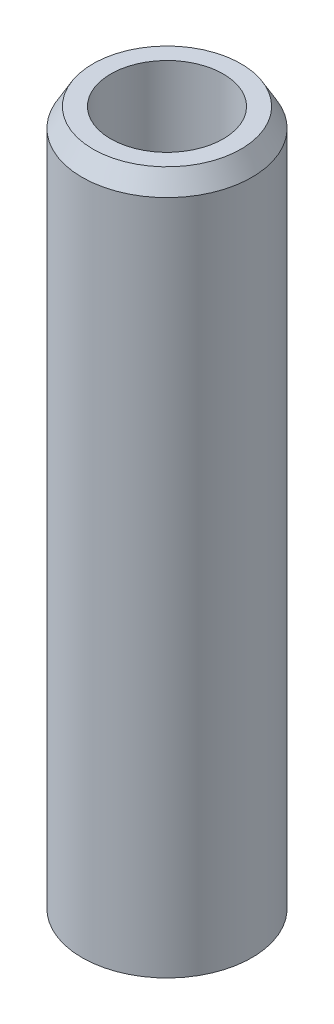
ISO-10303-21;
HEADER;
FILE_DESCRIPTION(('STEP AP214'),'2;1');
FILE_NAME('part.step','',(''),(''),'','','');
FILE_SCHEMA(('AUTOMOTIVE_DESIGN { 1 0 10303 214 1 1 1 1 }'));
ENDSEC;
DATA;
#1=APPLICATION_CONTEXT('core data for automotive mechanical design processes');
#2=APPLICATION_PROTOCOL_DEFINITION('international standard','automotive_design',2000,#1);
#3=PRODUCT_CONTEXT('',#1,'mechanical');
#4=PRODUCT('Part','Part','',(#3));
#5=PRODUCT_RELATED_PRODUCT_CATEGORY('part','',(#4));
#6=PRODUCT_DEFINITION_FORMATION('','',#4);
#7=PRODUCT_DEFINITION_CONTEXT('part definition',#1,'design');
#8=PRODUCT_DEFINITION('design','',#6,#7);
#9=PRODUCT_DEFINITION_SHAPE('','',#8);
#10=(LENGTH_UNIT() NAMED_UNIT(*) SI_UNIT(.MILLI.,.METRE.));
#11=(NAMED_UNIT(*) PLANE_ANGLE_UNIT() SI_UNIT($,.RADIAN.));
#12=(NAMED_UNIT(*) SI_UNIT($,.STERADIAN.) SOLID_ANGLE_UNIT());
#13=UNCERTAINTY_MEASURE_WITH_UNIT(LENGTH_MEASURE(1.E-05),#10,'distance_accuracy_value','');
#14=(GEOMETRIC_REPRESENTATION_CONTEXT(3) GLOBAL_UNCERTAINTY_ASSIGNED_CONTEXT((#13)) GLOBAL_UNIT_ASSIGNED_CONTEXT((#10,
#11,#12)) REPRESENTATION_CONTEXT('',''));
#15=CARTESIAN_POINT('',(0.,0.,0.));
#16=DIRECTION('',(0.,0.,1.));
#17=DIRECTION('',(1.,0.,0.));
#18=AXIS2_PLACEMENT_3D('',#15,#16,#17);
#19=CARTESIAN_POINT('',(0.,186.930161326391,0.));
#20=DIRECTION('',(0.,-1.,0.));
#21=DIRECTION('',(0.,0.,-1.));
#22=AXIS2_PLACEMENT_3D('',#19,#20,#21);
#23=CYLINDRICAL_SURFACE('',#22,22.5);
#24=CARTESIAN_POINT('',(0.,181.912026177805,0.));
#25=DIRECTION('',(0.,1.,0.));
#26=DIRECTION('',(0.,0.,1.));
#27=AXIS2_PLACEMENT_3D('',#24,#25,#26);
#28=CIRCLE('',#27,22.5);
#29=CARTESIAN_POINT('',(0.,181.912026177805,22.5));
#30=VERTEX_POINT('',#29);
#31=EDGE_CURVE('E50',#30,#30,#28,.F.);
#32=ORIENTED_EDGE('',*,*,#31,.T.);
#33=EDGE_LOOP('',(#32));
#34=FACE_BOUND('',#33,.T.);
#35=CARTESIAN_POINT('',(0.,2.89722167886566,0.));
#36=DIRECTION('',(0.,1.,0.));
#37=DIRECTION('',(0.,0.,1.));
#38=AXIS2_PLACEMENT_3D('',#35,#36,#37);
#39=CIRCLE('',#38,22.5);
#40=CARTESIAN_POINT('',(0.,2.89722167886566,22.5));
#41=VERTEX_POINT('',#40);
#42=EDGE_CURVE('E51',#41,#41,#39,.T.);
#43=ORIENTED_EDGE('',*,*,#42,.T.);
#44=EDGE_LOOP('',(#43));
#45=FACE_BOUND('',#44,.T.);
#46=ADVANCED_FACE('F39',(#34,#45),#23,.T.);
#47=CARTESIAN_POINT('',(0.,186.930161326391,0.));
#48=DIRECTION('',(0.,1.,0.));
#49=DIRECTION('',(0.,0.,1.));
#50=AXIS2_PLACEMENT_3D('',#47,#48,#49);
#51=PLANE('',#50);
#52=CARTESIAN_POINT('',(0.,186.930161326391,0.));
#53=DIRECTION('',(0.,1.,0.));
#54=DIRECTION('',(0.,0.,1.));
#55=AXIS2_PLACEMENT_3D('',#52,#53,#54);
#56=CIRCLE('',#55,19.6027783211343);
#57=CARTESIAN_POINT('',(0.,186.930161326391,19.6027783211343));
#58=VERTEX_POINT('',#57);
#59=EDGE_CURVE('E54',#58,#58,#56,.T.);
#60=ORIENTED_EDGE('',*,*,#59,.T.);
#61=EDGE_LOOP('',(#60));
#62=FACE_BOUND('',#61,.T.);
#63=CARTESIAN_POINT('',(0.,186.930161326391,0.));
#64=DIRECTION('',(0.,1.,0.));
#65=DIRECTION('',(0.,0.,1.));
#66=AXIS2_PLACEMENT_3D('',#63,#64,#65);
#67=CIRCLE('',#66,14.9091989872699);
#68=CARTESIAN_POINT('',(0.,186.930161326391,14.9091989872699));
#69=VERTEX_POINT('',#68);
#70=EDGE_CURVE('E58',#69,#69,#67,.T.);
#71=ORIENTED_EDGE('',*,*,#70,.F.);
#72=EDGE_LOOP('',(#71));
#73=FACE_BOUND('',#72,.T.);
#74=ADVANCED_FACE('F69',(#62,#73),#51,.T.);
#75=CARTESIAN_POINT('',(0.,0.,0.));
#76=DIRECTION('',(0.,1.,0.));
#77=DIRECTION('',(0.,0.,1.));
#78=AXIS2_PLACEMENT_3D('',#75,#76,#77);
#79=PLANE('',#78);
#80=CARTESIAN_POINT('',(0.,0.,0.));
#81=DIRECTION('',(0.,1.,0.));
#82=DIRECTION('',(0.,0.,1.));
#83=AXIS2_PLACEMENT_3D('',#80,#81,#82);
#84=CIRCLE('',#83,17.4818648514146);
#85=CARTESIAN_POINT('',(0.,0.,17.4818648514146));
#86=VERTEX_POINT('',#85);
#87=EDGE_CURVE('E10',#86,#86,#84,.F.);
#88=ORIENTED_EDGE('',*,*,#87,.T.);
#89=EDGE_LOOP('',(#88));
#90=FACE_BOUND('',#89,.T.);
#91=CARTESIAN_POINT('',(0.,0.,0.));
#92=DIRECTION('',(0.,1.,0.));
#93=DIRECTION('',(0.,0.,1.));
#94=AXIS2_PLACEMENT_3D('',#91,#92,#93);
#95=CIRCLE('',#94,14.9091989872699);
#96=CARTESIAN_POINT('',(0.,0.,14.9091989872699));
#97=VERTEX_POINT('',#96);
#98=EDGE_CURVE('E63',#97,#97,#95,.T.);
#99=ORIENTED_EDGE('',*,*,#98,.T.);
#100=EDGE_LOOP('',(#99));
#101=FACE_BOUND('',#100,.T.);
#102=ADVANCED_FACE('F75',(#90,#101),#79,.F.);
#103=CARTESIAN_POINT('',(0.,186.930161326391,0.));
#104=DIRECTION('',(0.,-1.,0.));
#105=DIRECTION('',(0.,0.,-1.));
#106=AXIS2_PLACEMENT_3D('',#103,#104,#105);
#107=CYLINDRICAL_SURFACE('',#106,14.9091989872699);
#108=ORIENTED_EDGE('',*,*,#70,.T.);
#109=EDGE_LOOP('',(#108));
#110=FACE_BOUND('',#109,.T.);
#111=ORIENTED_EDGE('',*,*,#98,.F.);
#112=EDGE_LOOP('',(#111));
#113=FACE_BOUND('',#112,.T.);
#114=ADVANCED_FACE('F70',(#110,#113),#107,.F.);
#115=CARTESIAN_POINT('',(0.,186.930161326391,0.));
#116=DIRECTION('',(0.,-1.,0.));
#117=DIRECTION('',(0.,0.,-1.));
#118=AXIS2_PLACEMENT_3D('',#115,#116,#117);
#119=CONICAL_SURFACE('',#118,19.6027783211343,0.523598775598295);
#120=ORIENTED_EDGE('',*,*,#31,.F.);
#121=EDGE_LOOP('',(#120));
#122=FACE_BOUND('',#121,.T.);
#123=ORIENTED_EDGE('',*,*,#59,.F.);
#124=EDGE_LOOP('',(#123));
#125=FACE_BOUND('',#124,.T.);
#126=ADVANCED_FACE('F81',(#122,#125),#119,.T.);
#127=CARTESIAN_POINT('',(0.,2.89722167886566,0.));
#128=DIRECTION('',(0.,1.,0.));
#129=DIRECTION('',(0.,0.,1.));
#130=AXIS2_PLACEMENT_3D('',#127,#128,#129);
#131=CONICAL_SURFACE('',#130,22.5,1.0471975511966);
#132=ORIENTED_EDGE('',*,*,#87,.F.);
#133=EDGE_LOOP('',(#132));
#134=FACE_BOUND('',#133,.T.);
#135=ORIENTED_EDGE('',*,*,#42,.F.);
#136=EDGE_LOOP('',(#135));
#137=FACE_BOUND('',#136,.T.);
#138=ADVANCED_FACE('F45',(#134,#137),#131,.T.);
#139=CLOSED_SHELL('',(#46,#74,#102,#114,#126,#138));
#140=MANIFOLD_SOLID_BREP('B2',#139);
#141=ADVANCED_BREP_SHAPE_REPRESENTATION('',(#18,#140),#14);
#142=SHAPE_DEFINITION_REPRESENTATION(#9,#141);
ENDSEC;
END-ISO-10303-21;
